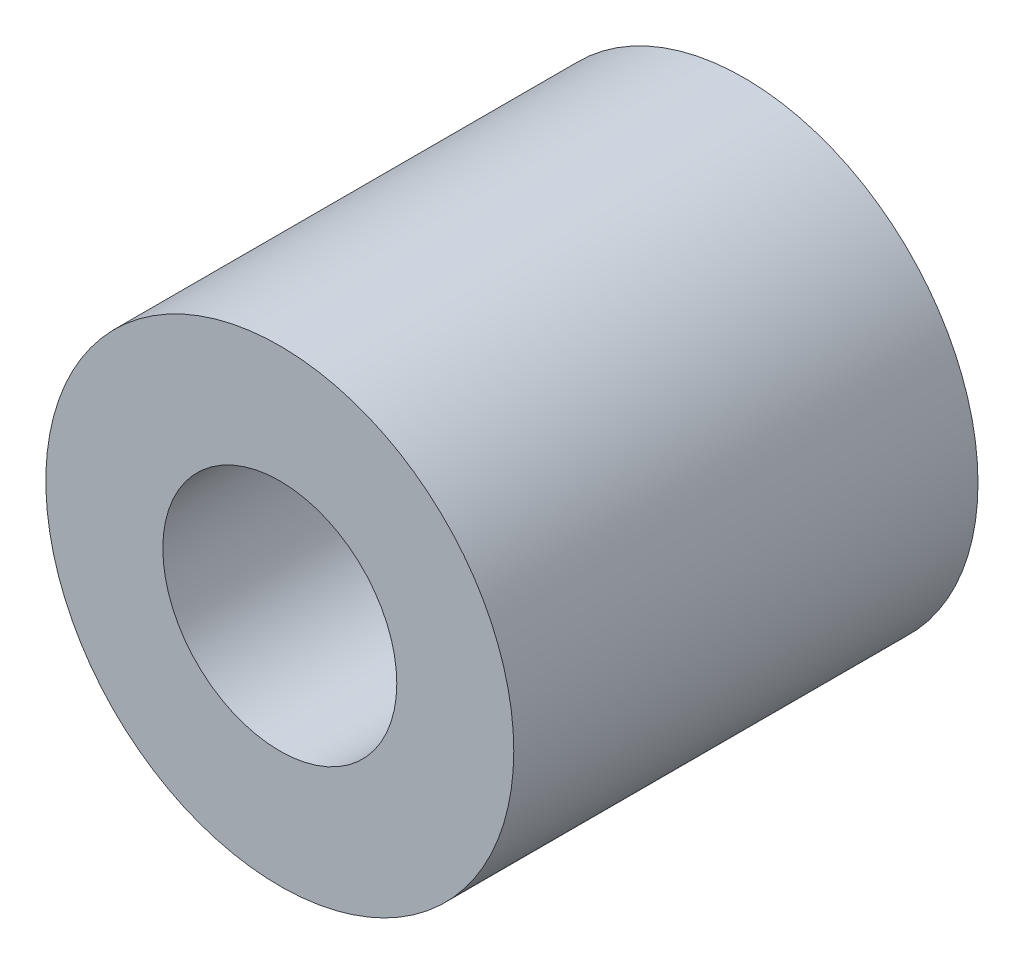
ISO-10303-21;
HEADER;
FILE_DESCRIPTION(('STEP AP214'),'2;1');
FILE_NAME('part.step','',(''),(''),'','','');
FILE_SCHEMA(('AUTOMOTIVE_DESIGN { 1 0 10303 214 1 1 1 1 }'));
ENDSEC;
DATA;
#1=APPLICATION_CONTEXT('core data for automotive mechanical design processes');
#2=APPLICATION_PROTOCOL_DEFINITION('international standard','automotive_design',2000,#1);
#3=PRODUCT_CONTEXT('',#1,'mechanical');
#4=PRODUCT('Part','Part','',(#3));
#5=PRODUCT_RELATED_PRODUCT_CATEGORY('part','',(#4));
#6=PRODUCT_DEFINITION_FORMATION('','',#4);
#7=PRODUCT_DEFINITION_CONTEXT('part definition',#1,'design');
#8=PRODUCT_DEFINITION('design','',#6,#7);
#9=PRODUCT_DEFINITION_SHAPE('','',#8);
#10=(LENGTH_UNIT() NAMED_UNIT(*) SI_UNIT(.MILLI.,.METRE.));
#11=(NAMED_UNIT(*) PLANE_ANGLE_UNIT() SI_UNIT($,.RADIAN.));
#12=(NAMED_UNIT(*) SI_UNIT($,.STERADIAN.) SOLID_ANGLE_UNIT());
#13=UNCERTAINTY_MEASURE_WITH_UNIT(LENGTH_MEASURE(1.E-05),#10,'distance_accuracy_value','');
#14=(GEOMETRIC_REPRESENTATION_CONTEXT(3) GLOBAL_UNCERTAINTY_ASSIGNED_CONTEXT((#13)) GLOBAL_UNIT_ASSIGNED_CONTEXT((#10,
#11,#12)) REPRESENTATION_CONTEXT('',''));
#15=CARTESIAN_POINT('',(0.,0.,0.));
#16=DIRECTION('',(0.,0.,1.));
#17=DIRECTION('',(1.,0.,0.));
#18=AXIS2_PLACEMENT_3D('',#15,#16,#17);
#19=CARTESIAN_POINT('',(0.,0.,3.175));
#20=DIRECTION('',(0.,0.,1.));
#21=DIRECTION('',(1.,0.,0.));
#22=AXIS2_PLACEMENT_3D('',#19,#20,#21);
#23=PLANE('',#22);
#24=CARTESIAN_POINT('',(0.,0.,3.175));
#25=DIRECTION('',(0.,0.,1.));
#26=DIRECTION('',(1.,0.,0.));
#27=AXIS2_PLACEMENT_3D('',#24,#25,#26);
#28=CIRCLE('',#27,3.2004);
#29=CARTESIAN_POINT('',(3.2004,0.,3.175));
#30=VERTEX_POINT('',#29);
#31=EDGE_CURVE('E10',#30,#30,#28,.T.);
#32=ORIENTED_EDGE('',*,*,#31,.T.);
#33=EDGE_LOOP('',(#32));
#34=FACE_BOUND('',#33,.T.);
#35=CARTESIAN_POINT('',(0.,0.,3.175));
#36=DIRECTION('',(0.,0.,1.));
#37=DIRECTION('',(1.,0.,0.));
#38=AXIS2_PLACEMENT_3D('',#35,#36,#37);
#39=CIRCLE('',#38,1.6002);
#40=CARTESIAN_POINT('',(1.6002,0.,3.175));
#41=VERTEX_POINT('',#40);
#42=EDGE_CURVE('E42',#41,#41,#39,.T.);
#43=ORIENTED_EDGE('',*,*,#42,.F.);
#44=EDGE_LOOP('',(#43));
#45=FACE_BOUND('',#44,.T.);
#46=ADVANCED_FACE('F35',(#34,#45),#23,.T.);
#47=CARTESIAN_POINT('',(0.,0.,3.175));
#48=DIRECTION('',(0.,0.,-1.));
#49=DIRECTION('',(-1.,0.,0.));
#50=AXIS2_PLACEMENT_3D('',#47,#48,#49);
#51=CYLINDRICAL_SURFACE('',#50,3.2004);
#52=ORIENTED_EDGE('',*,*,#31,.F.);
#53=EDGE_LOOP('',(#52));
#54=FACE_BOUND('',#53,.T.);
#55=CARTESIAN_POINT('',(0.,0.,-3.175));
#56=DIRECTION('',(0.,0.,1.));
#57=DIRECTION('',(1.,0.,0.));
#58=AXIS2_PLACEMENT_3D('',#55,#56,#57);
#59=CIRCLE('',#58,3.2004);
#60=CARTESIAN_POINT('',(3.2004,0.,-3.175));
#61=VERTEX_POINT('',#60);
#62=EDGE_CURVE('E46',#61,#61,#59,.T.);
#63=ORIENTED_EDGE('',*,*,#62,.T.);
#64=EDGE_LOOP('',(#63));
#65=FACE_BOUND('',#64,.T.);
#66=ADVANCED_FACE('F37',(#54,#65),#51,.T.);
#67=CARTESIAN_POINT('',(0.,0.,3.175));
#68=DIRECTION('',(0.,0.,-1.));
#69=DIRECTION('',(-1.,0.,0.));
#70=AXIS2_PLACEMENT_3D('',#67,#68,#69);
#71=CYLINDRICAL_SURFACE('',#70,1.6002);
#72=ORIENTED_EDGE('',*,*,#42,.T.);
#73=EDGE_LOOP('',(#72));
#74=FACE_BOUND('',#73,.T.);
#75=CARTESIAN_POINT('',(0.,0.,-3.175));
#76=DIRECTION('',(0.,0.,1.));
#77=DIRECTION('',(1.,0.,0.));
#78=AXIS2_PLACEMENT_3D('',#75,#76,#77);
#79=CIRCLE('',#78,1.6002);
#80=CARTESIAN_POINT('',(1.6002,0.,-3.175));
#81=VERTEX_POINT('',#80);
#82=EDGE_CURVE('E50',#81,#81,#79,.T.);
#83=ORIENTED_EDGE('',*,*,#82,.F.);
#84=EDGE_LOOP('',(#83));
#85=FACE_BOUND('',#84,.T.);
#86=ADVANCED_FACE('F59',(#74,#85),#71,.F.);
#87=CARTESIAN_POINT('',(0.,0.,-3.175));
#88=DIRECTION('',(0.,0.,1.));
#89=DIRECTION('',(1.,0.,0.));
#90=AXIS2_PLACEMENT_3D('',#87,#88,#89);
#91=PLANE('',#90);
#92=ORIENTED_EDGE('',*,*,#82,.T.);
#93=EDGE_LOOP('',(#92));
#94=FACE_BOUND('',#93,.T.);
#95=ORIENTED_EDGE('',*,*,#62,.F.);
#96=EDGE_LOOP('',(#95));
#97=FACE_BOUND('',#96,.T.);
#98=ADVANCED_FACE('F56',(#94,#97),#91,.F.);
#99=CLOSED_SHELL('',(#46,#66,#86,#98));
#100=MANIFOLD_SOLID_BREP('B2',#99);
#101=ADVANCED_BREP_SHAPE_REPRESENTATION('',(#18,#100),#14);
#102=SHAPE_DEFINITION_REPRESENTATION(#9,#101);
ENDSEC;
END-ISO-10303-21;
